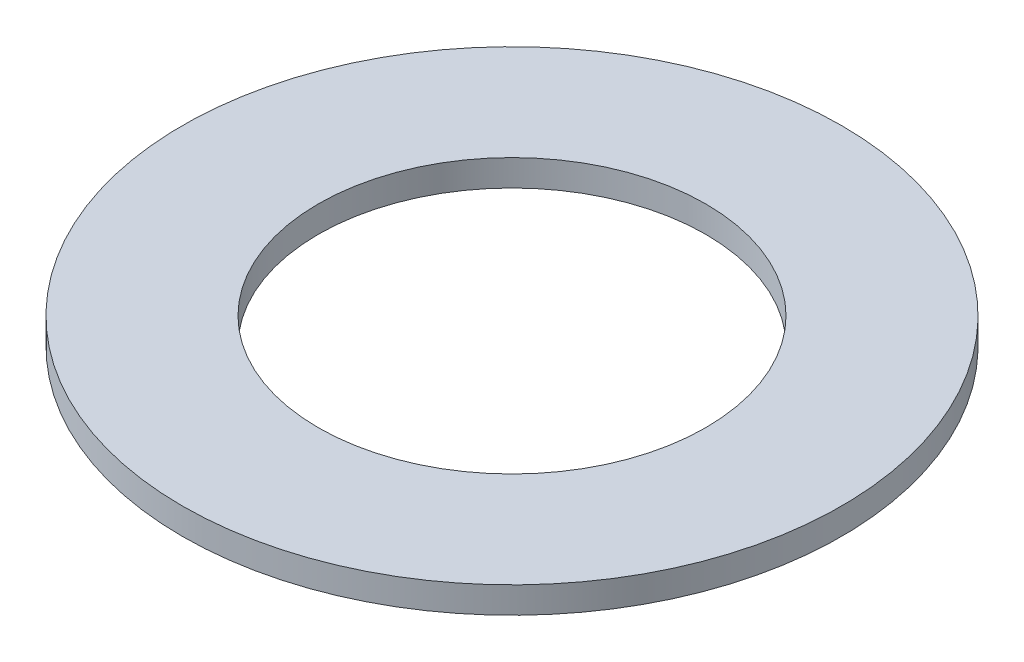
ISO-10303-21;
HEADER;
FILE_DESCRIPTION(('STEP AP214'),'2;1');
FILE_NAME('part.step','',(''),(''),'','','');
FILE_SCHEMA(('AUTOMOTIVE_DESIGN { 1 0 10303 214 1 1 1 1 }'));
ENDSEC;
DATA;
#1=APPLICATION_CONTEXT('core data for automotive mechanical design processes');
#2=APPLICATION_PROTOCOL_DEFINITION('international standard','automotive_design',2000,#1);
#3=PRODUCT_CONTEXT('',#1,'mechanical');
#4=PRODUCT('Part','Part','',(#3));
#5=PRODUCT_RELATED_PRODUCT_CATEGORY('part','',(#4));
#6=PRODUCT_DEFINITION_FORMATION('','',#4);
#7=PRODUCT_DEFINITION_CONTEXT('part definition',#1,'design');
#8=PRODUCT_DEFINITION('design','',#6,#7);
#9=PRODUCT_DEFINITION_SHAPE('','',#8);
#10=(LENGTH_UNIT() NAMED_UNIT(*) SI_UNIT(.MILLI.,.METRE.));
#11=(NAMED_UNIT(*) PLANE_ANGLE_UNIT() SI_UNIT($,.RADIAN.));
#12=(NAMED_UNIT(*) SI_UNIT($,.STERADIAN.) SOLID_ANGLE_UNIT());
#13=UNCERTAINTY_MEASURE_WITH_UNIT(LENGTH_MEASURE(1.E-05),#10,'distance_accuracy_value','');
#14=(GEOMETRIC_REPRESENTATION_CONTEXT(3) GLOBAL_UNCERTAINTY_ASSIGNED_CONTEXT((#13)) GLOBAL_UNIT_ASSIGNED_CONTEXT((#10,
#11,#12)) REPRESENTATION_CONTEXT('',''));
#15=CARTESIAN_POINT('',(0.,0.,0.));
#16=DIRECTION('',(0.,0.,1.));
#17=DIRECTION('',(1.,0.,0.));
#18=AXIS2_PLACEMENT_3D('',#15,#16,#17);
#19=CARTESIAN_POINT('',(0.,1.,0.));
#20=DIRECTION('',(0.,1.,0.));
#21=DIRECTION('',(0.,0.,1.));
#22=AXIS2_PLACEMENT_3D('',#19,#20,#21);
#23=PLANE('',#22);
#24=CARTESIAN_POINT('',(0.,1.,0.));
#25=DIRECTION('',(0.,1.,0.));
#26=DIRECTION('',(0.,0.,1.));
#27=AXIS2_PLACEMENT_3D('',#24,#25,#26);
#28=CIRCLE('',#27,12.5);
#29=CARTESIAN_POINT('',(0.,1.,12.5));
#30=VERTEX_POINT('',#29);
#31=EDGE_CURVE('E10',#30,#30,#28,.T.);
#32=ORIENTED_EDGE('',*,*,#31,.T.);
#33=EDGE_LOOP('',(#32));
#34=FACE_BOUND('',#33,.T.);
#35=CARTESIAN_POINT('',(0.,1.,0.));
#36=DIRECTION('',(0.,1.,0.));
#37=DIRECTION('',(0.,0.,1.));
#38=AXIS2_PLACEMENT_3D('',#35,#36,#37);
#39=CIRCLE('',#38,7.35);
#40=CARTESIAN_POINT('',(0.,1.,7.35));
#41=VERTEX_POINT('',#40);
#42=EDGE_CURVE('E54',#41,#41,#39,.T.);
#43=ORIENTED_EDGE('',*,*,#42,.F.);
#44=EDGE_LOOP('',(#43));
#45=FACE_BOUND('',#44,.T.);
#46=ADVANCED_FACE('F41',(#34,#45),#23,.T.);
#47=CARTESIAN_POINT('',(0.,0.,0.));
#48=DIRECTION('',(0.,1.,0.));
#49=DIRECTION('',(0.,0.,1.));
#50=AXIS2_PLACEMENT_3D('',#47,#48,#49);
#51=PLANE('',#50);
#52=CARTESIAN_POINT('',(0.,0.,0.));
#53=DIRECTION('',(0.,1.,0.));
#54=DIRECTION('',(0.,0.,1.));
#55=AXIS2_PLACEMENT_3D('',#52,#53,#54);
#56=CIRCLE('',#55,12.5);
#57=CARTESIAN_POINT('',(0.,0.,12.5));
#58=VERTEX_POINT('',#57);
#59=EDGE_CURVE('E45',#58,#58,#56,.T.);
#60=ORIENTED_EDGE('',*,*,#59,.F.);
#61=EDGE_LOOP('',(#60));
#62=FACE_BOUND('',#61,.T.);
#63=CARTESIAN_POINT('',(0.,0.,0.));
#64=DIRECTION('',(0.,1.,0.));
#65=DIRECTION('',(0.,0.,1.));
#66=AXIS2_PLACEMENT_3D('',#63,#64,#65);
#67=CIRCLE('',#66,7.35);
#68=CARTESIAN_POINT('',(0.,0.,7.35));
#69=VERTEX_POINT('',#68);
#70=EDGE_CURVE('E56',#69,#69,#67,.T.);
#71=ORIENTED_EDGE('',*,*,#70,.T.);
#72=EDGE_LOOP('',(#71));
#73=FACE_BOUND('',#72,.T.);
#74=ADVANCED_FACE('F68',(#62,#73),#51,.F.);
#75=CARTESIAN_POINT('',(0.,1.,0.));
#76=DIRECTION('',(0.,-1.,0.));
#77=DIRECTION('',(0.,0.,-1.));
#78=AXIS2_PLACEMENT_3D('',#75,#76,#77);
#79=CYLINDRICAL_SURFACE('',#78,12.5);
#80=ORIENTED_EDGE('',*,*,#31,.F.);
#81=EDGE_LOOP('',(#80));
#82=FACE_BOUND('',#81,.T.);
#83=ORIENTED_EDGE('',*,*,#59,.T.);
#84=EDGE_LOOP('',(#83));
#85=FACE_BOUND('',#84,.T.);
#86=ADVANCED_FACE('F43',(#82,#85),#79,.T.);
#87=CARTESIAN_POINT('',(0.,1.,0.));
#88=DIRECTION('',(0.,-1.,0.));
#89=DIRECTION('',(0.,0.,-1.));
#90=AXIS2_PLACEMENT_3D('',#87,#88,#89);
#91=CYLINDRICAL_SURFACE('',#90,7.35);
#92=ORIENTED_EDGE('',*,*,#42,.T.);
#93=EDGE_LOOP('',(#92));
#94=FACE_BOUND('',#93,.T.);
#95=ORIENTED_EDGE('',*,*,#70,.F.);
#96=EDGE_LOOP('',(#95));
#97=FACE_BOUND('',#96,.T.);
#98=ADVANCED_FACE('F64',(#94,#97),#91,.F.);
#99=CLOSED_SHELL('',(#46,#74,#86,#98));
#100=MANIFOLD_SOLID_BREP('B2',#99);
#101=ADVANCED_BREP_SHAPE_REPRESENTATION('',(#18,#100),#14);
#102=SHAPE_DEFINITION_REPRESENTATION(#9,#101);
ENDSEC;
END-ISO-10303-21;
